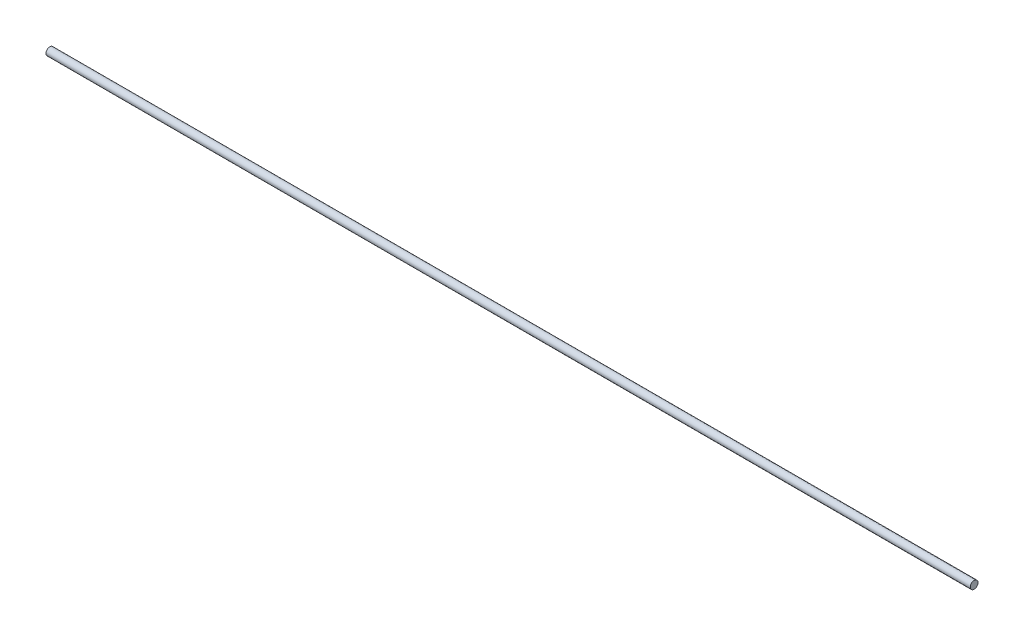
ISO-10303-21;
HEADER;
FILE_DESCRIPTION(('STEP AP214'),'2;1');
FILE_NAME('part.step','',(''),(''),'','','');
FILE_SCHEMA(('AUTOMOTIVE_DESIGN { 1 0 10303 214 1 1 1 1 }'));
ENDSEC;
DATA;
#1=APPLICATION_CONTEXT('core data for automotive mechanical design processes');
#2=APPLICATION_PROTOCOL_DEFINITION('international standard','automotive_design',2000,#1);
#3=PRODUCT_CONTEXT('',#1,'mechanical');
#4=PRODUCT('Part','Part','',(#3));
#5=PRODUCT_RELATED_PRODUCT_CATEGORY('part','',(#4));
#6=PRODUCT_DEFINITION_FORMATION('','',#4);
#7=PRODUCT_DEFINITION_CONTEXT('part definition',#1,'design');
#8=PRODUCT_DEFINITION('design','',#6,#7);
#9=PRODUCT_DEFINITION_SHAPE('','',#8);
#10=(LENGTH_UNIT() NAMED_UNIT(*) SI_UNIT(.MILLI.,.METRE.));
#11=(NAMED_UNIT(*) PLANE_ANGLE_UNIT() SI_UNIT($,.RADIAN.));
#12=(NAMED_UNIT(*) SI_UNIT($,.STERADIAN.) SOLID_ANGLE_UNIT());
#13=UNCERTAINTY_MEASURE_WITH_UNIT(LENGTH_MEASURE(1.E-05),#10,'distance_accuracy_value','');
#14=(GEOMETRIC_REPRESENTATION_CONTEXT(3) GLOBAL_UNCERTAINTY_ASSIGNED_CONTEXT((#13)) GLOBAL_UNIT_ASSIGNED_CONTEXT((#10,
#11,#12)) REPRESENTATION_CONTEXT('',''));
#15=CARTESIAN_POINT('',(0.,0.,0.));
#16=DIRECTION('',(0.,0.,1.));
#17=DIRECTION('',(1.,0.,0.));
#18=AXIS2_PLACEMENT_3D('',#15,#16,#17);
#19=CARTESIAN_POINT('',(762.,0.,0.));
#20=DIRECTION('',(-1.,0.,0.));
#21=DIRECTION('',(0.,0.,1.));
#22=AXIS2_PLACEMENT_3D('',#19,#20,#21);
#23=CYLINDRICAL_SURFACE('',#22,3.175);
#24=CARTESIAN_POINT('',(762.,0.,0.));
#25=DIRECTION('',(1.,0.,0.));
#26=DIRECTION('',(0.,0.,-1.));
#27=AXIS2_PLACEMENT_3D('',#24,#25,#26);
#28=CIRCLE('',#27,3.175);
#29=CARTESIAN_POINT('',(762.,0.,-3.175));
#30=VERTEX_POINT('',#29);
#31=EDGE_CURVE('E10',#30,#30,#28,.T.);
#32=ORIENTED_EDGE('',*,*,#31,.F.);
#33=EDGE_LOOP('',(#32));
#34=FACE_BOUND('',#33,.T.);
#35=CARTESIAN_POINT('',(0.,0.,0.));
#36=DIRECTION('',(1.,0.,0.));
#37=DIRECTION('',(0.,0.,-1.));
#38=AXIS2_PLACEMENT_3D('',#35,#36,#37);
#39=CIRCLE('',#38,3.175);
#40=CARTESIAN_POINT('',(0.,0.,-3.175));
#41=VERTEX_POINT('',#40);
#42=EDGE_CURVE('E40',#41,#41,#39,.T.);
#43=ORIENTED_EDGE('',*,*,#42,.T.);
#44=EDGE_LOOP('',(#43));
#45=FACE_BOUND('',#44,.T.);
#46=ADVANCED_FACE('F37',(#34,#45),#23,.T.);
#47=CARTESIAN_POINT('',(762.,0.,0.));
#48=DIRECTION('',(1.,0.,0.));
#49=DIRECTION('',(0.,0.,-1.));
#50=AXIS2_PLACEMENT_3D('',#47,#48,#49);
#51=PLANE('',#50);
#52=ORIENTED_EDGE('',*,*,#31,.T.);
#53=EDGE_LOOP('',(#52));
#54=FACE_BOUND('',#53,.T.);
#55=ADVANCED_FACE('F54',(#54),#51,.T.);
#56=CARTESIAN_POINT('',(0.,0.,0.));
#57=DIRECTION('',(1.,0.,0.));
#58=DIRECTION('',(0.,0.,-1.));
#59=AXIS2_PLACEMENT_3D('',#56,#57,#58);
#60=PLANE('',#59);
#61=ORIENTED_EDGE('',*,*,#42,.F.);
#62=EDGE_LOOP('',(#61));
#63=FACE_BOUND('',#62,.T.);
#64=ADVANCED_FACE('F52',(#63),#60,.F.);
#65=CLOSED_SHELL('',(#46,#55,#64));
#66=MANIFOLD_SOLID_BREP('B2',#65);
#67=ADVANCED_BREP_SHAPE_REPRESENTATION('',(#18,#66),#14);
#68=SHAPE_DEFINITION_REPRESENTATION(#9,#67);
ENDSEC;
END-ISO-10303-21;
